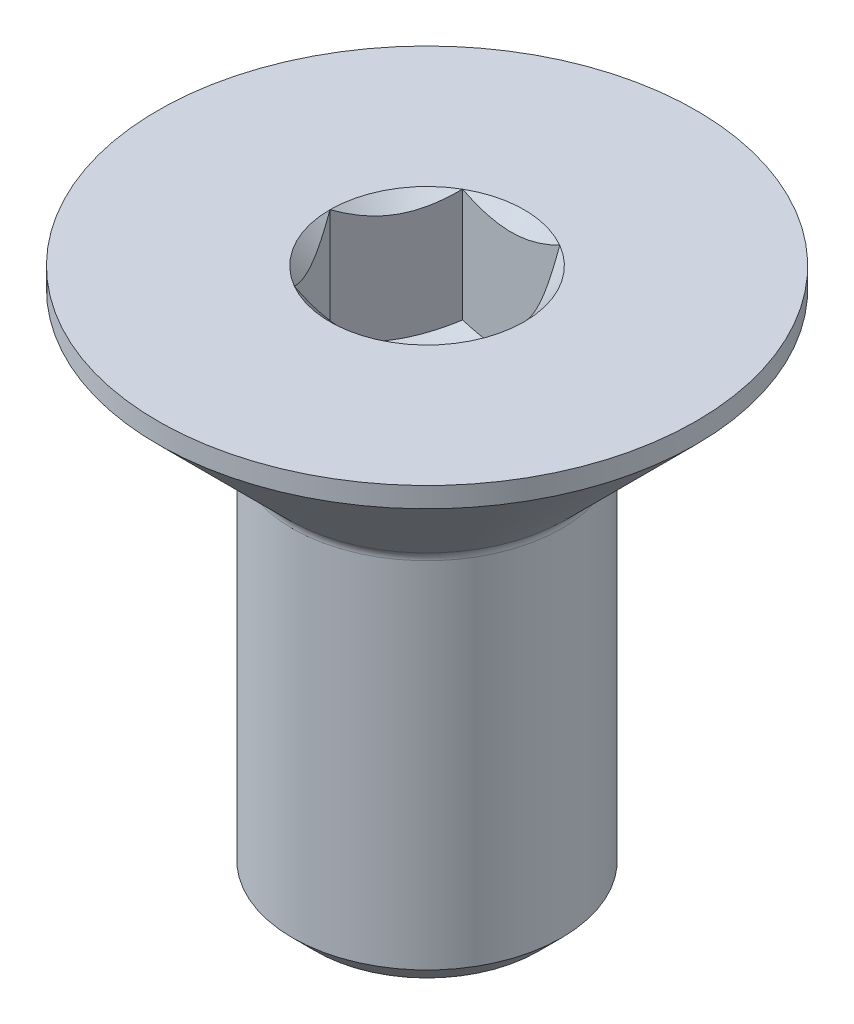
ISO-10303-21;
HEADER;
FILE_DESCRIPTION(('STEP AP214'),'2;1');
FILE_NAME('part.step','',(''),(''),'','','');
FILE_SCHEMA(('AUTOMOTIVE_DESIGN { 1 0 10303 214 1 1 1 1 }'));
ENDSEC;
DATA;
#1=APPLICATION_CONTEXT('core data for automotive mechanical design processes');
#2=APPLICATION_PROTOCOL_DEFINITION('international standard','automotive_design',2000,#1);
#3=PRODUCT_CONTEXT('',#1,'mechanical');
#4=PRODUCT('Part','Part','',(#3));
#5=PRODUCT_RELATED_PRODUCT_CATEGORY('part','',(#4));
#6=PRODUCT_DEFINITION_FORMATION('','',#4);
#7=PRODUCT_DEFINITION_CONTEXT('part definition',#1,'design');
#8=PRODUCT_DEFINITION('design','',#6,#7);
#9=PRODUCT_DEFINITION_SHAPE('','',#8);
#10=(LENGTH_UNIT() NAMED_UNIT(*) SI_UNIT(.MILLI.,.METRE.));
#11=(NAMED_UNIT(*) PLANE_ANGLE_UNIT() SI_UNIT($,.RADIAN.));
#12=(NAMED_UNIT(*) SI_UNIT($,.STERADIAN.) SOLID_ANGLE_UNIT());
#13=UNCERTAINTY_MEASURE_WITH_UNIT(LENGTH_MEASURE(1.E-05),#10,'distance_accuracy_value','');
#14=(GEOMETRIC_REPRESENTATION_CONTEXT(3) GLOBAL_UNCERTAINTY_ASSIGNED_CONTEXT((#13)) GLOBAL_UNIT_ASSIGNED_CONTEXT((#10,
#11,#12)) REPRESENTATION_CONTEXT('',''));
#15=CARTESIAN_POINT('',(0.,0.,0.));
#16=DIRECTION('',(0.,0.,1.));
#17=DIRECTION('',(1.,0.,0.));
#18=AXIS2_PLACEMENT_3D('',#15,#16,#17);
#19=CARTESIAN_POINT('',(1.65000000000349,-8.,0.));
#20=DIRECTION('',(0.,-1.,0.));
#21=DIRECTION('',(1.,0.,0.));
#22=AXIS2_PLACEMENT_3D('',#19,#20,#21);
#23=PLANE('',#22);
#24=CARTESIAN_POINT('',(0.,-8.00000000000001,0.));
#25=DIRECTION('',(0.,-1.,0.));
#26=DIRECTION('',(1.,0.,0.));
#27=AXIS2_PLACEMENT_3D('',#24,#25,#26);
#28=CIRCLE('',#27,1.65000000000346);
#29=CARTESIAN_POINT('',(1.65000000000349,-8.,0.));
#30=VERTEX_POINT('',#29);
#31=EDGE_CURVE('E45',#30,#30,#28,.T.);
#32=ORIENTED_EDGE('',*,*,#31,.T.);
#33=EDGE_LOOP('',(#32));
#34=FACE_BOUND('',#33,.T.);
#35=ADVANCED_FACE('F32',(#34),#23,.T.);
#36=CARTESIAN_POINT('',(0.,-8.00000000000001,0.));
#37=DIRECTION('',(0.,1.,0.));
#38=DIRECTION('',(-1.,0.,0.));
#39=AXIS2_PLACEMENT_3D('',#36,#37,#38);
#40=CONICAL_SURFACE('',#39,1.65000000000346,0.785398163397346);
#41=CARTESIAN_POINT('',(0.,-7.64999999999993,0.));
#42=DIRECTION('',(0.,-1.,0.));
#43=DIRECTION('',(1.,0.,0.));
#44=AXIS2_PLACEMENT_3D('',#41,#42,#43);
#45=CIRCLE('',#44,2.00000000000347);
#46=CARTESIAN_POINT('',(2.00000000000349,-7.64999999999993,0.));
#47=VERTEX_POINT('',#46);
#48=EDGE_CURVE('E235',#47,#47,#45,.T.);
#49=ORIENTED_EDGE('',*,*,#48,.T.);
#50=EDGE_LOOP('',(#49));
#51=FACE_BOUND('',#50,.T.);
#52=ORIENTED_EDGE('',*,*,#31,.F.);
#53=EDGE_LOOP('',(#52));
#54=FACE_BOUND('',#53,.T.);
#55=ADVANCED_FACE('F241',(#51,#54),#40,.T.);
#56=CARTESIAN_POINT('',(3.49148133884313E-12,-1000.,0.));
#57=DIRECTION('',(0.,-1.,0.));
#58=DIRECTION('',(1.,0.,0.));
#59=AXIS2_PLACEMENT_3D('',#56,#57,#58);
#60=CYLINDRICAL_SURFACE('',#59,2.00000000000347);
#61=CARTESIAN_POINT('',(0.,-2.3828427124748,0.));
#62=DIRECTION('',(0.,-1.,0.));
#63=DIRECTION('',(1.,0.,0.));
#64=AXIS2_PLACEMENT_3D('',#61,#62,#63);
#65=CIRCLE('',#64,2.00000000000348);
#66=CARTESIAN_POINT('',(2.00000000000349,-2.38284271247479,0.));
#67=VERTEX_POINT('',#66);
#68=EDGE_CURVE('E232',#67,#67,#65,.T.);
#69=ORIENTED_EDGE('',*,*,#68,.T.);
#70=EDGE_LOOP('',(#69));
#71=FACE_BOUND('',#70,.T.);
#72=ORIENTED_EDGE('',*,*,#48,.F.);
#73=EDGE_LOOP('',(#72));
#74=FACE_BOUND('',#73,.T.);
#75=ADVANCED_FACE('F243',(#71,#74),#60,.T.);
#76=CARTESIAN_POINT('',(0.,-2.3828427124748,0.));
#77=DIRECTION('',(0.,-1.,0.));
#78=DIRECTION('',(1.,0.,0.));
#79=AXIS2_PLACEMENT_3D('',#76,#77,#78);
#80=TOROIDAL_SURFACE('',#79,2.20000000000348,0.2);
#81=CARTESIAN_POINT('',(0.,-2.24142135623751,0.));
#82=DIRECTION('',(0.,-1.,0.));
#83=DIRECTION('',(1.,0.,0.));
#84=AXIS2_PLACEMENT_3D('',#81,#82,#83);
#85=CIRCLE('',#84,2.05857864376617);
#86=CARTESIAN_POINT('',(2.05857864376618,-2.2414213562375,0.));
#87=VERTEX_POINT('',#86);
#88=EDGE_CURVE('E229',#87,#87,#85,.T.);
#89=ORIENTED_EDGE('',*,*,#88,.T.);
#90=EDGE_LOOP('',(#89));
#91=FACE_BOUND('',#90,.T.);
#92=ORIENTED_EDGE('',*,*,#68,.F.);
#93=EDGE_LOOP('',(#92));
#94=FACE_BOUND('',#93,.T.);
#95=ADVANCED_FACE('F249',(#91,#94),#80,.F.);
#96=CARTESIAN_POINT('',(0.,-2.24142135623751,0.));
#97=DIRECTION('',(0.,1.,0.));
#98=DIRECTION('',(-1.,0.,0.));
#99=AXIS2_PLACEMENT_3D('',#96,#97,#98);
#100=CONICAL_SURFACE('',#99,2.05857864376617,0.785398163397393);
#101=CARTESIAN_POINT('',(0.,-0.299999999999967,0.));
#102=DIRECTION('',(0.,-1.,0.));
#103=DIRECTION('',(1.,0.,0.));
#104=AXIS2_PLACEMENT_3D('',#101,#102,#103);
#105=CIRCLE('',#104,4.00000000000349);
#106=CARTESIAN_POINT('',(4.00000000000349,-0.299999999999953,0.));
#107=VERTEX_POINT('',#106);
#108=EDGE_CURVE('E226',#107,#107,#105,.T.);
#109=ORIENTED_EDGE('',*,*,#108,.T.);
#110=EDGE_LOOP('',(#109));
#111=FACE_BOUND('',#110,.T.);
#112=ORIENTED_EDGE('',*,*,#88,.F.);
#113=EDGE_LOOP('',(#112));
#114=FACE_BOUND('',#113,.T.);
#115=ADVANCED_FACE('F255',(#111,#114),#100,.T.);
#116=CARTESIAN_POINT('',(3.49148133884313E-12,-1000.,0.));
#117=DIRECTION('',(0.,-1.,0.));
#118=DIRECTION('',(1.,0.,0.));
#119=AXIS2_PLACEMENT_3D('',#116,#117,#118);
#120=CYLINDRICAL_SURFACE('',#119,4.00000000000349);
#121=CARTESIAN_POINT('',(0.,0.,0.));
#122=DIRECTION('',(0.,-1.,0.));
#123=DIRECTION('',(1.,0.,0.));
#124=AXIS2_PLACEMENT_3D('',#121,#122,#123);
#125=CIRCLE('',#124,4.00000000000349);
#126=CARTESIAN_POINT('',(4.00000000000349,0.,0.));
#127=VERTEX_POINT('',#126);
#128=EDGE_CURVE('E223',#127,#127,#125,.T.);
#129=ORIENTED_EDGE('',*,*,#128,.T.);
#130=EDGE_LOOP('',(#129));
#131=FACE_BOUND('',#130,.T.);
#132=ORIENTED_EDGE('',*,*,#108,.F.);
#133=EDGE_LOOP('',(#132));
#134=FACE_BOUND('',#133,.T.);
#135=ADVANCED_FACE('F259',(#131,#134),#120,.T.);
#136=CARTESIAN_POINT('',(1.25000000000349,0.,0.));
#137=DIRECTION('',(0.,1.,0.));
#138=DIRECTION('',(-1.,0.,0.));
#139=AXIS2_PLACEMENT_3D('',#136,#137,#138);
#140=PLANE('',#139);
#141=CARTESIAN_POINT('',(0.,0.,0.));
#142=DIRECTION('',(0.,-1.,0.));
#143=DIRECTION('',(1.,0.,0.));
#144=AXIS2_PLACEMENT_3D('',#141,#142,#143);
#145=CIRCLE('',#144,1.4433756729781);
#146=CARTESIAN_POINT('',(-0.721687836489047,0.,1.25000000000349));
#147=VERTEX_POINT('',#146);
#148=CARTESIAN_POINT('',(-1.4433756729781,0.,0.));
#149=VERTEX_POINT('',#148);
#150=EDGE_CURVE('E103',#147,#149,#145,.T.);
#151=ORIENTED_EDGE('',*,*,#150,.T.);
#152=CARTESIAN_POINT('',(-0.721687836489048,0.,-1.25000000000349));
#153=VERTEX_POINT('',#152);
#154=EDGE_CURVE('E94',#149,#153,#145,.T.);
#155=ORIENTED_EDGE('',*,*,#154,.T.);
#156=CARTESIAN_POINT('',(0.721687836489048,0.,-1.25000000000349));
#157=VERTEX_POINT('',#156);
#158=EDGE_CURVE('E104',#153,#157,#145,.T.);
#159=ORIENTED_EDGE('',*,*,#158,.T.);
#160=CARTESIAN_POINT('',(1.4433756729781,0.,0.));
#161=VERTEX_POINT('',#160);
#162=EDGE_CURVE('E51',#157,#161,#145,.T.);
#163=ORIENTED_EDGE('',*,*,#162,.T.);
#164=CARTESIAN_POINT('',(0.721687836489048,0.,1.25000000000349));
#165=VERTEX_POINT('',#164);
#166=EDGE_CURVE('E58',#161,#165,#145,.T.);
#167=ORIENTED_EDGE('',*,*,#166,.T.);
#168=EDGE_CURVE('E132',#165,#147,#145,.T.);
#169=ORIENTED_EDGE('',*,*,#168,.T.);
#170=EDGE_LOOP('',(#151,#155,#159,#163,#167,#169));
#171=FACE_BOUND('',#170,.T.);
#172=ORIENTED_EDGE('',*,*,#128,.F.);
#173=EDGE_LOOP('',(#172));
#174=FACE_BOUND('',#173,.T.);
#175=ADVANCED_FACE('F130',(#171,#174),#140,.T.);
#176=CARTESIAN_POINT('',(0.,-1.44337567297459,0.));
#177=DIRECTION('',(0.,1.,0.));
#178=DIRECTION('',(-1.,0.,0.));
#179=AXIS2_PLACEMENT_3D('',#176,#177,#178);
#180=CONICAL_SURFACE('',#179,3.486441819616E-12,0.785398163397455);
#181=ORIENTED_EDGE('',*,*,#150,.F.);
#182=CARTESIAN_POINT('',(-1.44349114303193,0.000115483909129891,-0.000199999999999219));
#183=CARTESIAN_POINT('',(-1.41867941875461,-0.0246783319449714,0.0427751670717079));
#184=CARTESIAN_POINT('',(-1.39345276981132,-0.0480162655814565,0.0864690047461916));
#185=CARTESIAN_POINT('',(-1.34201263554569,-0.0907479959157224,0.175565930842435));
#186=CARTESIAN_POINT('',(-1.31579425481644,-0.110118007639899,0.220977498357684));
#187=CARTESIAN_POINT('',(-1.26292610442599,-0.143299516586928,0.312547820936136));
#188=CARTESIAN_POINT('',(-1.23628980770816,-0.157194440947788,0.358683240176892));
#189=CARTESIAN_POINT('',(-1.18243062538838,-0.178602717839864,0.45197008040886));
#190=CARTESIAN_POINT('',(-1.15520938654084,-0.186132058433737,0.499118649137779));
#191=CARTESIAN_POINT('',(-1.10829684367776,-0.192925501949839,0.580373556888879));
#192=CARTESIAN_POINT('',(-1.08866617257262,-0.193931440896195,0.614374876629663));
#193=CARTESIAN_POINT('',(-1.04943932800904,-0.19223858508922,0.68231776443439));
#194=CARTESIAN_POINT('',(-1.02984316311886,-0.189538972784993,0.716259317657666));
#195=CARTESIAN_POINT('',(-0.990839954606261,-0.180591069684128,0.783814856459697));
#196=CARTESIAN_POINT('',(-0.971433104251478,-0.174339474100782,0.817428507289067));
#197=CARTESIAN_POINT('',(-0.932943395612505,-0.158624318586539,0.884094638220292));
#198=CARTESIAN_POINT('',(-0.913860680100846,-0.149159379912958,0.917146871032868));
#199=CARTESIAN_POINT('',(-0.864986351356978,-0.121068609312751,1.00179969160307));
#200=CARTESIAN_POINT('',(-0.835502920151405,-0.10032984254808,1.05286649243259));
#201=CARTESIAN_POINT('',(-0.777690319478078,-0.0536128653286748,1.15300085411648));
#202=CARTESIAN_POINT('',(-0.749357745600508,-0.0276517040533135,1.20207431158163));
#203=CARTESIAN_POINT('',(-0.721572366435209,0.000115483909132839,1.25020000000349));
#204=B_SPLINE_CURVE_WITH_KNOTS('',3,(#182,#183,#184,#185,#186,#187,#188,#189,#190,#191,#192,
#193,#194,#195,#196,#197,#198,#199,#200,#201,#202,#203),.UNSPECIFIED.,.F.,.F.,(4,2,2,2,2,2,2,2,
2,2,4),(0.,0.16653340961877,0.334037607290696,0.498880396491094,0.663307919242131,
0.780963963461013,0.89864597015097,1.01643764861058,1.13427993171867,1.3214865203251,
1.50809158792994),.UNSPECIFIED.);
#205=EDGE_CURVE('E11',#149,#147,#204,.T.);
#206=ORIENTED_EDGE('',*,*,#205,.F.);
#207=EDGE_LOOP('',(#181,#206));
#208=FACE_BOUND('',#207,.T.);
#209=ADVANCED_FACE('F108',(#208),#180,.F.);
#210=ORIENTED_EDGE('',*,*,#168,.F.);
#211=CARTESIAN_POINT('',(-1.43934010829456,0.462982097051989,1.25000000000349));
#212=CARTESIAN_POINT('',(-1.4042931302644,0.43652492278638,1.25000000000349));
#213=CARTESIAN_POINT('',(-1.3690508715578,0.410327160501609,1.25000000000349));
#214=CARTESIAN_POINT('',(-1.29809650725286,0.358557571974628,1.25000000000349));
#215=CARTESIAN_POINT('',(-1.26238428594864,0.332985904485213,1.25000000000349));
#216=CARTESIAN_POINT('',(-1.15390111809222,0.257005993799896,1.25000000000349));
#217=CARTESIAN_POINT('',(-1.08031646741517,0.20774028628773,1.25000000000349));
#218=CARTESIAN_POINT('',(-0.926012322880137,0.111025830336069,1.25000000000349));
#219=CARTESIAN_POINT('',(-0.845125318766239,0.0638412990018703,1.25000000000349));
#220=CARTESIAN_POINT('',(-0.679311174155533,-0.022469265573359,1.25000000000349));
#221=CARTESIAN_POINT('',(-0.594398891089416,-0.0616224653478704,1.25000000000349));
#222=CARTESIAN_POINT('',(-0.46694481251109,-0.109522776294703,1.25000000000349));
#223=CARTESIAN_POINT('',(-0.426289985868076,-0.123270510196388,1.25000000000349));
#224=CARTESIAN_POINT('',(-0.343998850156493,-0.147502072532647,1.25000000000349));
#225=CARTESIAN_POINT('',(-0.302362473685254,-0.157985676114154,1.25000000000349));
#226=CARTESIAN_POINT('',(-0.219052696365918,-0.174969838238265,1.25000000000349));
#227=CARTESIAN_POINT('',(-0.177393428559645,-0.181538639517064,1.25000000000349));
#228=CARTESIAN_POINT('',(-0.0936293694349521,-0.190564946535536,1.25000000000349));
#229=CARTESIAN_POINT('',(-0.0515246559538788,-0.193023158999019,1.25000000000349));
#230=CARTESIAN_POINT('',(0.0311890575224513,-0.193645937989816,1.25000000000349));
#231=CARTESIAN_POINT('',(0.0717969624377628,-0.191962883160621,1.25000000000349));
#232=CARTESIAN_POINT('',(0.152668636765459,-0.184731729417062,1.25000000000349));
#233=CARTESIAN_POINT('',(0.192932338712038,-0.17918288960621,1.25000000000349));
#234=CARTESIAN_POINT('',(0.273499879034908,-0.164428963563456,1.25000000000349));
#235=CARTESIAN_POINT('',(0.313792180484651,-0.155161824069079,1.25000000000349));
#236=CARTESIAN_POINT('',(0.393496413770995,-0.133463821585486,1.25000000000349));
#237=CARTESIAN_POINT('',(0.432908418971468,-0.121033223317061,1.25000000000349));
#238=CARTESIAN_POINT('',(0.55699273568753,-0.0772206471392824,1.25000000000349));
#239=CARTESIAN_POINT('',(0.639898924464845,-0.0408489272159497,1.25000000000349));
#240=CARTESIAN_POINT('',(0.801816555247556,0.0400191620417341,1.25000000000349));
#241=CARTESIAN_POINT('',(0.880812666048479,0.0845447207518592,1.25000000000349));
#242=CARTESIAN_POINT('',(1.03178561247705,0.176404876461487,1.25000000000349));
#243=CARTESIAN_POINT('',(1.10391618451079,0.223489933689833,1.25000000000349));
#244=CARTESIAN_POINT('',(1.21018606006404,0.296278561340321,1.25000000000349));
#245=CARTESIAN_POINT('',(1.24515069931519,0.320798085124626,1.25000000000349));
#246=CARTESIAN_POINT('',(1.31460220812977,0.370485636475934,1.25000000000349));
#247=CARTESIAN_POINT('',(1.34908920555911,0.395653485115273,1.25000000000349));
#248=CARTESIAN_POINT('',(1.3833773164126,0.42109014853048,1.25000000000349));
#249=B_SPLINE_CURVE_WITH_KNOTS('',3,(#211,#212,#213,#214,#215,#216,#217,#218,#219,#220,#221,
#222,#223,#224,#225,#226,#227,#228,#229,#230,#231,#232,#233,#234,#235,#236,#237,#238,#239,#240,
#241,#242,#243,#244,#245,#246,#247,#248),.UNSPECIFIED.,.F.,.F.,(4,2,2,2,2,2,2,2,2,2,2,2,2,2,2,2,
2,2,4),(0.,0.131732960406922,0.263498984212599,0.529042014558685,0.809741926295641,
1.08947609739089,1.21811634293026,1.34676544802937,1.47310084535527,1.59941451990114,
1.72115042182942,1.84290966145587,1.96679153917858,2.09066305377221,2.36146692897408,
2.63325989190042,2.89154668195411,3.01965734486693,3.14773302220456),.UNSPECIFIED.);
#250=EDGE_CURVE('E134',#147,#165,#249,.T.);
#251=ORIENTED_EDGE('',*,*,#250,.F.);
#252=EDGE_LOOP('',(#210,#251));
#253=FACE_BOUND('',#252,.T.);
#254=ADVANCED_FACE('F267',(#253),#180,.F.);
#255=ORIENTED_EDGE('',*,*,#166,.F.);
#256=CARTESIAN_POINT('',(0.721572366435211,0.00011548390913795,1.25020000000349));
#257=CARTESIAN_POINT('',(0.74638409071253,-0.0246783319449632,1.20722483293178));
#258=CARTESIAN_POINT('',(0.771610739655821,-0.0480162655814483,1.1635309952573));
#259=CARTESIAN_POINT('',(0.823050873921455,-0.090747995915714,1.07443406916106));
#260=CARTESIAN_POINT('',(0.849269254650707,-0.110118007639891,1.02902250164581));
#261=CARTESIAN_POINT('',(0.902137405041158,-0.14329951658692,0.937452179067356));
#262=CARTESIAN_POINT('',(0.928773701758984,-0.15719444094778,0.891316759826601));
#263=CARTESIAN_POINT('',(0.98263288407876,-0.178602717839856,0.798029919594633));
#264=CARTESIAN_POINT('',(1.00985412292631,-0.186132058433728,0.750881350865714));
#265=CARTESIAN_POINT('',(1.05676666578938,-0.192925501949831,0.669626443114614));
#266=CARTESIAN_POINT('',(1.07639733689453,-0.193931440896187,0.635625123373829));
#267=CARTESIAN_POINT('',(1.11562418145811,-0.192238585089212,0.567682235569102));
#268=CARTESIAN_POINT('',(1.13522034634828,-0.189538972784985,0.533740682345827));
#269=CARTESIAN_POINT('',(1.17422355486088,-0.18059106968412,0.466185143543795));
#270=CARTESIAN_POINT('',(1.19363040521567,-0.174339474100774,0.432571492714426));
#271=CARTESIAN_POINT('',(1.23212011385464,-0.158624318586531,0.3659053617832));
#272=CARTESIAN_POINT('',(1.2512028293663,-0.14915937991295,0.332853128970625));
#273=CARTESIAN_POINT('',(1.30007715811017,-0.121068609312744,0.248200308400421));
#274=CARTESIAN_POINT('',(1.32956058931574,-0.100329842548072,0.197133507570906));
#275=CARTESIAN_POINT('',(1.38737318998907,-0.0536128653286669,0.0969991458870134));
#276=CARTESIAN_POINT('',(1.41570576386664,-0.0276517040533056,0.0479256884218633));
#277=CARTESIAN_POINT('',(1.44349114303193,0.000115483909140393,-0.000200000000000403));
#278=B_SPLINE_CURVE_WITH_KNOTS('',3,(#256,#257,#258,#259,#260,#261,#262,#263,#264,#265,#266,
#267,#268,#269,#270,#271,#272,#273,#274,#275,#276,#277),.UNSPECIFIED.,.F.,.F.,(4,2,2,2,2,2,2,2,
2,2,4),(0.,0.166533409618769,0.334037607290696,0.498880396491094,0.663307919242131,
0.780963963461013,0.89864597015097,1.01643764861058,1.13427993171867,1.3214865203251,
1.50809158792994),.UNSPECIFIED.);
#279=EDGE_CURVE('E142',#165,#161,#278,.T.);
#280=ORIENTED_EDGE('',*,*,#279,.F.);
#281=EDGE_LOOP('',(#255,#280));
#282=FACE_BOUND('',#281,.T.);
#283=ADVANCED_FACE('F271',(#282),#180,.F.);
#284=ORIENTED_EDGE('',*,*,#162,.F.);
#285=CARTESIAN_POINT('',(1.44349114303193,0.000115483909140748,0.000199999999999486));
#286=CARTESIAN_POINT('',(1.41867941875462,-0.0246783319449607,-0.0427751670717077));
#287=CARTESIAN_POINT('',(1.39345276981132,-0.048016265581446,-0.0864690047461914));
#288=CARTESIAN_POINT('',(1.34201263554569,-0.0907479959157123,-0.175565930842435));
#289=CARTESIAN_POINT('',(1.31579425481644,-0.110118007639889,-0.220977498357684));
#290=CARTESIAN_POINT('',(1.26292610442599,-0.143299516586919,-0.312547820936137));
#291=CARTESIAN_POINT('',(1.23628980770816,-0.157194440947779,-0.358683240176892));
#292=CARTESIAN_POINT('',(1.18243062538839,-0.178602717839855,-0.45197008040886));
#293=CARTESIAN_POINT('',(1.15520938654084,-0.186132058433728,-0.499118649137779));
#294=CARTESIAN_POINT('',(1.10829684367776,-0.192925501949831,-0.580373556888879));
#295=CARTESIAN_POINT('',(1.08866617257262,-0.193931440896187,-0.614374876629663));
#296=CARTESIAN_POINT('',(1.04943932800904,-0.192238585089213,-0.68231776443439));
#297=CARTESIAN_POINT('',(1.02984316311887,-0.189538972784986,-0.716259317657666));
#298=CARTESIAN_POINT('',(0.990839954606263,-0.180591069684121,-0.783814856459697));
#299=CARTESIAN_POINT('',(0.97143310425148,-0.174339474100775,-0.817428507289067));
#300=CARTESIAN_POINT('',(0.932943395612506,-0.158624318586532,-0.884094638220292));
#301=CARTESIAN_POINT('',(0.913860680100848,-0.149159379912951,-0.917146871032868));
#302=CARTESIAN_POINT('',(0.864986351356979,-0.121068609312745,-1.00179969160307));
#303=CARTESIAN_POINT('',(0.835502920151406,-0.100329842548073,-1.05286649243259));
#304=CARTESIAN_POINT('',(0.777690319478079,-0.0536128653286691,-1.15300085411648));
#305=CARTESIAN_POINT('',(0.749357745600509,-0.0276517040533081,-1.20207431158163));
#306=CARTESIAN_POINT('',(0.72157236643521,0.00011548390913791,-1.25020000000349));
#307=B_SPLINE_CURVE_WITH_KNOTS('',3,(#285,#286,#287,#288,#289,#290,#291,#292,#293,#294,#295,
#296,#297,#298,#299,#300,#301,#302,#303,#304,#305,#306),.UNSPECIFIED.,.F.,.F.,(4,2,2,2,2,2,2,2,
2,2,4),(0.,0.16653340961877,0.334037607290697,0.498880396491095,0.663307919242131,
0.780963963461014,0.89864597015097,1.01643764861058,1.13427993171867,1.3214865203251,
1.50809158792994),.UNSPECIFIED.);
#308=EDGE_CURVE('E164',#161,#157,#307,.T.);
#309=ORIENTED_EDGE('',*,*,#308,.F.);
#310=EDGE_LOOP('',(#284,#309));
#311=FACE_BOUND('',#310,.T.);
#312=ADVANCED_FACE('F276',(#311),#180,.F.);
#313=ORIENTED_EDGE('',*,*,#158,.F.);
#314=CARTESIAN_POINT('',(-1.43934010808536,0.46298209689404,-1.25000000000349));
#315=CARTESIAN_POINT('',(-1.40429313006107,0.436524922634515,-1.25000000000349));
#316=CARTESIAN_POINT('',(-1.36905087136036,0.41032716035582,-1.25000000000349));
#317=CARTESIAN_POINT('',(-1.29809650706726,0.358557571840954,-1.25000000000349));
#318=CARTESIAN_POINT('',(-1.26238428576899,0.332985904357579,-1.25000000000349));
#319=CARTESIAN_POINT('',(-1.15390111793078,0.257005993690498,-1.25000000000349));
#320=CARTESIAN_POINT('',(-1.08031646726612,0.207740286190437,-1.25000000000349));
#321=CARTESIAN_POINT('',(-0.926012322758085,0.111025830263676,-1.25000000000349));
#322=CARTESIAN_POINT('',(-0.84512531865888,0.0638412989421791,-1.25000000000349));
#323=CARTESIAN_POINT('',(-0.679311174078812,-0.0224692656095032,-1.25000000000349));
#324=CARTESIAN_POINT('',(-0.594398891028629,-0.061622465373154,-1.25000000000349));
#325=CARTESIAN_POINT('',(-0.466944812462283,-0.109522776311931,-1.25000000000349));
#326=CARTESIAN_POINT('',(-0.426289985814242,-0.123270510213935,-1.25000000000349));
#327=CARTESIAN_POINT('',(-0.34399885009244,-0.147502072549813,-1.25000000000349));
#328=CARTESIAN_POINT('',(-0.302362473616009,-0.157985676130621,-1.25000000000349));
#329=CARTESIAN_POINT('',(-0.21905269628646,-0.174969838252159,-1.25000000000349));
#330=CARTESIAN_POINT('',(-0.177393428475169,-0.181538639529113,-1.25000000000349));
#331=CARTESIAN_POINT('',(-0.0936293693406071,-0.190564946542761,-1.25000000000349));
#332=CARTESIAN_POINT('',(-0.0515246558546831,-0.193023159003264,-1.25000000000349));
#333=CARTESIAN_POINT('',(0.0311890576305937,-0.193645937987258,-1.25000000000349));
#334=CARTESIAN_POINT('',(0.0717969625500137,-0.191962883154295,-1.25000000000349));
#335=CARTESIAN_POINT('',(0.152668636885522,-0.184731729402613,-1.25000000000349));
#336=CARTESIAN_POINT('',(0.192932338835803,-0.179182889587405,-1.25000000000349));
#337=CARTESIAN_POINT('',(0.273499879165982,-0.164428963535521,-1.25000000000349));
#338=CARTESIAN_POINT('',(0.313792180619318,-0.155161824036343,-1.25000000000349));
#339=CARTESIAN_POINT('',(0.393496413912503,-0.13346382154304,-1.25000000000349));
#340=CARTESIAN_POINT('',(0.432908419116223,-0.121033223269706,-1.25000000000349));
#341=CARTESIAN_POINT('',(0.55699273586381,-0.0772206470687936,-1.25000000000349));
#342=CARTESIAN_POINT('',(0.639898924667823,-0.0408489271241785,-1.25000000000349));
#343=CARTESIAN_POINT('',(0.801816555501879,0.0400191621784154,-1.25000000000349));
#344=CARTESIAN_POINT('',(0.880812666327437,0.084544720912185,-1.25000000000349));
#345=CARTESIAN_POINT('',(1.0317856128003,0.176404876667069,-1.25000000000349));
#346=CARTESIAN_POINT('',(1.10391618485386,0.22348993391682,-1.25000000000349));
#347=CARTESIAN_POINT('',(1.2101860604364,0.296278561599304,-1.25000000000349));
#348=CARTESIAN_POINT('',(1.24515069969718,0.32079808539419,-1.25000000000349));
#349=CARTESIAN_POINT('',(1.31460220853094,0.370485636766646,-1.25000000000349));
#350=CARTESIAN_POINT('',(1.34908920596985,0.395653485416553,-1.25000000000349));
#351=CARTESIAN_POINT('',(1.38337731683288,0.421090148842315,-1.25000000000349));
#352=B_SPLINE_CURVE_WITH_KNOTS('',3,(#314,#315,#316,#317,#318,#319,#320,#321,#322,#323,#324,
#325,#326,#327,#328,#329,#330,#331,#332,#333,#334,#335,#336,#337,#338,#339,#340,#341,#342,#343,
#344,#345,#346,#347,#348,#349,#350,#351),.UNSPECIFIED.,.F.,.F.,(4,2,2,2,2,2,2,2,2,2,2,2,2,2,2,2,
2,2,4),(0.,0.131732960381867,0.263498984162482,0.529042014457507,0.809741926137206,
1.08947609717574,1.21811634272965,1.34676544784328,1.4731008451831,1.59941451974289,
1.7211504216839,1.84290966132312,1.96679153905956,2.0906630536669,2.36146692896733,
2.63325989199289,2.89154668213147,3.01965734508616,3.14773302246566),.UNSPECIFIED.);
#353=EDGE_CURVE('E121',#157,#153,#352,.F.);
#354=ORIENTED_EDGE('',*,*,#353,.F.);
#355=EDGE_LOOP('',(#313,#354));
#356=FACE_BOUND('',#355,.T.);
#357=ADVANCED_FACE('F155',(#356),#180,.F.);
#358=ORIENTED_EDGE('',*,*,#154,.F.);
#359=CARTESIAN_POINT('',(-0.72157236643521,0.000115483909132866,-1.25020000000349));
#360=CARTESIAN_POINT('',(-0.746384090712529,-0.0246783319449688,-1.20722483293178));
#361=CARTESIAN_POINT('',(-0.77161073965582,-0.0480162655814541,-1.1635309952573));
#362=CARTESIAN_POINT('',(-0.823050873921454,-0.0907479959157204,-1.07443406916106));
#363=CARTESIAN_POINT('',(-0.849269254650706,-0.110118007639897,-1.02902250164581));
#364=CARTESIAN_POINT('',(-0.902137405041157,-0.143299516586927,-0.937452179067356));
#365=CARTESIAN_POINT('',(-0.928773701758983,-0.157194440947786,-0.891316759826601));
#366=CARTESIAN_POINT('',(-0.982632884078759,-0.178602717839863,-0.798029919594632));
#367=CARTESIAN_POINT('',(-1.00985412292631,-0.186132058433736,-0.750881350865713));
#368=CARTESIAN_POINT('',(-1.05676666578938,-0.192925501949839,-0.669626443114613));
#369=CARTESIAN_POINT('',(-1.07639733689453,-0.193931440896195,-0.635625123373828));
#370=CARTESIAN_POINT('',(-1.11562418145811,-0.192238585089221,-0.567682235569101));
#371=CARTESIAN_POINT('',(-1.13522034634828,-0.189538972784994,-0.533740682345826));
#372=CARTESIAN_POINT('',(-1.17422355486088,-0.180591069684129,-0.466185143543794));
#373=CARTESIAN_POINT('',(-1.19363040521566,-0.174339474100783,-0.432571492714424));
#374=CARTESIAN_POINT('',(-1.23212011385464,-0.15862431858654,-0.365905361783199));
#375=CARTESIAN_POINT('',(-1.2512028293663,-0.149159379912959,-0.332853128970624));
#376=CARTESIAN_POINT('',(-1.30007715811016,-0.121068609312753,-0.24820030840042));
#377=CARTESIAN_POINT('',(-1.32956058931574,-0.100329842548082,-0.197133507570906));
#378=CARTESIAN_POINT('',(-1.38737318998906,-0.0536128653286775,-0.0969991458870126));
#379=CARTESIAN_POINT('',(-1.41570576386663,-0.0276517040533165,-0.0479256884218625));
#380=CARTESIAN_POINT('',(-1.44349114303193,0.00011548390913005,0.000200000000000735));
#381=B_SPLINE_CURVE_WITH_KNOTS('',3,(#359,#360,#361,#362,#363,#364,#365,#366,#367,#368,#369,
#370,#371,#372,#373,#374,#375,#376,#377,#378,#379,#380),.UNSPECIFIED.,.F.,.F.,(4,2,2,2,2,2,2,2,
2,2,4),(0.,0.16653340961877,0.334037607290697,0.498880396491095,0.663307919242132,
0.780963963461014,0.898645970150971,1.01643764861058,1.13427993171867,1.3214865203251,
1.50809158792995),.UNSPECIFIED.);
#382=EDGE_CURVE('E98',#153,#149,#381,.T.);
#383=ORIENTED_EDGE('',*,*,#382,.F.);
#384=EDGE_LOOP('',(#358,#383));
#385=FACE_BOUND('',#384,.T.);
#386=ADVANCED_FACE('F96',(#385),#180,.F.);
#387=CARTESIAN_POINT('',(0.,-1.80000000000002,0.));
#388=DIRECTION('',(0.,1.,0.));
#389=DIRECTION('',(-1.,0.,0.));
#390=AXIS2_PLACEMENT_3D('',#387,#388,#389);
#391=CONICAL_SURFACE('',#390,1.25000000000349,1.02974425867668);
#392=CARTESIAN_POINT('',(3.49148133884313E-12,-2.55107577378444,0.));
#393=VERTEX_POINT('',#392);
#394=VERTEX_LOOP('',#393);
#395=FACE_BOUND('',#394,.T.);
#396=CARTESIAN_POINT('',(-1.44349114303193,-1.68373878369851,0.000200000000000758));
#397=CARTESIAN_POINT('',(-1.41166056552225,-1.70287413373893,-0.0549321774810273));
#398=CARTESIAN_POINT('',(-1.37953238678244,-1.72028548653005,-0.110579815413018));
#399=CARTESIAN_POINT('',(-1.31467131835564,-1.75066975163604,-0.22292248136144));
#400=CARTESIAN_POINT('',(-1.28193705101929,-1.76363077161949,-0.279619895536542));
#401=CARTESIAN_POINT('',(-1.21690829049723,-1.78373800140125,-0.39225301271398));
#402=CARTESIAN_POINT('',(-1.18462556763811,-1.79103091489728,-0.448168328912636));
#403=CARTESIAN_POINT('',(-1.11989904931318,-1.79964889962364,-0.560277947248452));
#404=CARTESIAN_POINT('',(-1.08745553287882,-1.80098207990487,-0.616471766088976));
#405=CARTESIAN_POINT('',(-1.02711351628176,-1.79780199201309,-0.720987204666242));
#406=CARTESIAN_POINT('',(-0.999203806863338,-1.79406783704458,-0.76932823940343));
#407=CARTESIAN_POINT('',(-0.943582164544166,-1.78236747410617,-0.86566774990066));
#408=CARTESIAN_POINT('',(-0.915870460137415,-1.77439699110082,-0.913665829897483));
#409=CARTESIAN_POINT('',(-0.860127887355341,-1.75452233622549,-1.01021479810064));
#410=CARTESIAN_POINT('',(-0.832105201282622,-1.74252876876397,-1.05875151414314));
#411=CARTESIAN_POINT('',(-0.776509232231198,-1.71535561485019,-1.15504655723624));
#412=CARTESIAN_POINT('',(-0.748935115106377,-1.70018290883616,-1.20280632907028));
#413=CARTESIAN_POINT('',(-0.721572366435204,-1.68373878369851,-1.25020000000349));
#414=B_SPLINE_CURVE_WITH_KNOTS('',3,(#396,#397,#398,#399,#400,#401,#402,#403,#404,#405,#406,
#407,#408,#409,#410,#411,#412,#413),.UNSPECIFIED.,.F.,.F.,(4,2,2,2,2,2,2,2,4),(0.,
0.199512657915263,0.399554385152232,0.594228120804869,0.788636894821076,0.956299136616362,
1.12413089472599,1.29597067854706,1.46744233074892),.UNSPECIFIED.);
#415=CARTESIAN_POINT('',(-1.44337567297809,-1.68380817343164,0.));
#416=VERTEX_POINT('',#415);
#417=CARTESIAN_POINT('',(-0.72168783648918,-1.68380817343172,-1.25000000000349));
#418=VERTEX_POINT('',#417);
#419=EDGE_CURVE('E194',#416,#418,#414,.T.);
#420=ORIENTED_EDGE('',*,*,#419,.F.);
#421=CARTESIAN_POINT('',(-0.721572366435204,-1.68373878369851,1.25020000000349));
#422=CARTESIAN_POINT('',(-0.753402943944885,-1.70287413373893,1.19506782252246));
#423=CARTESIAN_POINT('',(-0.785531122684687,-1.72028548653004,1.13942018459047));
#424=CARTESIAN_POINT('',(-0.850392191111488,-1.75066975163604,1.02707751864205));
#425=CARTESIAN_POINT('',(-0.883126458447839,-1.76363077161949,0.970380104466949));
#426=CARTESIAN_POINT('',(-0.9481552189699,-1.78373800140125,0.857746987289511));
#427=CARTESIAN_POINT('',(-0.980437941829017,-1.79103091489727,0.801831671090855));
#428=CARTESIAN_POINT('',(-1.04516446015395,-1.79964889962364,0.689722052755039));
#429=CARTESIAN_POINT('',(-1.07760797658832,-1.80098207990487,0.633528233914515));
#430=CARTESIAN_POINT('',(-1.13794999318537,-1.79780199201309,0.52901279533725));
#431=CARTESIAN_POINT('',(-1.16585970260379,-1.79406783704458,0.480671760600061));
#432=CARTESIAN_POINT('',(-1.22148134492297,-1.78236747410617,0.384332250102832));
#433=CARTESIAN_POINT('',(-1.24919304932972,-1.77439699110082,0.336334170106008));
#434=CARTESIAN_POINT('',(-1.30493562211179,-1.75452233622549,0.239785201902849));
#435=CARTESIAN_POINT('',(-1.33295830818451,-1.74252876876397,0.191248485860349));
#436=CARTESIAN_POINT('',(-1.38855427723593,-1.71535561485019,0.0949534427672542));
#437=CARTESIAN_POINT('',(-1.41612839436076,-1.70018290883616,0.0471936709332087));
#438=CARTESIAN_POINT('',(-1.44349114303193,-1.68373878369851,-0.000199999999999307));
#439=B_SPLINE_CURVE_WITH_KNOTS('',3,(#421,#422,#423,#424,#425,#426,#427,#428,#429,#430,#431,
#432,#433,#434,#435,#436,#437,#438),.UNSPECIFIED.,.F.,.F.,(4,2,2,2,2,2,2,2,4),(0.,
0.199512657915263,0.399554385152233,0.594228120804869,0.788636894821076,0.956299136616363,
1.12413089472599,1.29597067854706,1.46744233074892),.UNSPECIFIED.);
#440=CARTESIAN_POINT('',(-0.721687836489041,-1.68380817343164,1.25000000000349));
#441=VERTEX_POINT('',#440);
#442=EDGE_CURVE('E125',#441,#416,#439,.T.);
#443=ORIENTED_EDGE('',*,*,#442,.F.);
#444=CARTESIAN_POINT('',(-1.95633569807406,-1.15612775041407,1.25000000000349));
#445=CARTESIAN_POINT('',(-1.90177877375264,-1.18374457873998,1.25000000000349));
#446=CARTESIAN_POINT('',(-1.84709077689568,-1.21110630849023,1.25000000000349));
#447=CARTESIAN_POINT('',(-1.73738286153345,-1.26517768956599,1.25000000000349));
#448=CARTESIAN_POINT('',(-1.68236289142449,-1.29188723607654,1.25000000000349));
#449=CARTESIAN_POINT('',(-1.57162683174927,-1.34465202901765,1.25000000000349));
#450=CARTESIAN_POINT('',(-1.51590856567755,-1.3707027285118,1.25000000000349));
#451=CARTESIAN_POINT('',(-1.40400572343869,-1.42177471825108,1.25000000000349));
#452=CARTESIAN_POINT('',(-1.34782117036307,-1.44679605911099,1.25000000000349));
#453=CARTESIAN_POINT('',(-1.17446186721262,-1.52166033554973,1.25000000000349));
#454=CARTESIAN_POINT('',(-1.05636778161659,-1.5694084237938,1.25000000000349));
#455=CARTESIAN_POINT('',(-0.816974893596707,-1.65565102430568,1.25000000000349));
#456=CARTESIAN_POINT('',(-0.695684569467109,-1.69416772529239,1.25000000000349));
#457=CARTESIAN_POINT('',(-0.511148008895669,-1.74031555097362,1.25000000000349));
#458=CARTESIAN_POINT('',(-0.449371057059273,-1.75373975965416,1.25000000000349));
#459=CARTESIAN_POINT('',(-0.324962773893435,-1.77585578640222,1.25000000000349));
#460=CARTESIAN_POINT('',(-0.262331574813842,-1.78454832866416,1.25000000000349));
#461=CARTESIAN_POINT('',(-0.137441721157349,-1.79636727757044,1.25000000000349));
#462=CARTESIAN_POINT('',(-0.0751906951126029,-1.79957205624218,1.25000000000349));
#463=CARTESIAN_POINT('',(0.0493491467112988,-1.80034769675674,1.25000000000349));
#464=CARTESIAN_POINT('',(0.111637964769692,-1.79791817598097,1.25000000000349));
#465=CARTESIAN_POINT('',(0.255543057352278,-1.78601127768817,1.25000000000349));
#466=CARTESIAN_POINT('',(0.336993495807891,-1.77453482690731,1.25000000000349));
#467=CARTESIAN_POINT('',(0.498435890885964,-1.74381125147862,1.25000000000349));
#468=CARTESIAN_POINT('',(0.578426259365225,-1.72455613761234,1.25000000000349));
#469=CARTESIAN_POINT('',(0.698169385498114,-1.6910569972249,1.25000000000349));
#470=CARTESIAN_POINT('',(0.73854181240987,-1.6789410423808,1.25000000000349));
#471=CARTESIAN_POINT('',(0.818854827558602,-1.65342511824778,1.25000000000349));
#472=CARTESIAN_POINT('',(0.858795649648098,-1.64002588754758,1.25000000000349));
#473=CARTESIAN_POINT('',(0.938293938986001,-1.61214509388012,1.25000000000349));
#474=CARTESIAN_POINT('',(0.977851414711371,-1.59766355490798,1.25000000000349));
#475=CARTESIAN_POINT('',(1.05662445455263,-1.5677871645207,1.25000000000349));
#476=CARTESIAN_POINT('',(1.09583997386484,-1.55239219542898,1.25000000000349));
#477=CARTESIAN_POINT('',(1.22650655936877,-1.49962207655801,1.25000000000349));
#478=CARTESIAN_POINT('',(1.31726645357689,-1.4605357037122,1.25000000000349));
#479=CARTESIAN_POINT('',(1.49752737704775,-1.3795480328937,1.25000000000349));
#480=CARTESIAN_POINT('',(1.58702809597521,-1.33764605519403,1.25000000000349));
#481=CARTESIAN_POINT('',(1.7651378170072,-1.25185780243867,1.25000000000349));
#482=CARTESIAN_POINT('',(1.85374623413003,-1.20797031763384,1.25000000000349));
#483=CARTESIAN_POINT('',(2.03025323651514,-1.11878711062617,1.25000000000349));
#484=CARTESIAN_POINT('',(2.11815178773777,-1.0734913213912,1.25000000000349));
#485=CARTESIAN_POINT('',(2.38149812693641,-0.935839596546094,1.25000000000349));
#486=CARTESIAN_POINT('',(2.55613976999247,-0.841944703208107,1.25000000000349));
#487=CARTESIAN_POINT('',(2.90406210123374,-0.651849748686266,1.25000000000349));
#488=CARTESIAN_POINT('',(3.0773433036529,-0.555650620295803,1.25000000000349));
#489=CARTESIAN_POINT('',(3.39747003309832,-0.37611619023932,1.25000000000349));
#490=CARTESIAN_POINT('',(3.5444304344659,-0.292985478002713,1.25000000000349));
#491=CARTESIAN_POINT('',(3.83793250552714,-0.12594868092238,1.25000000000349));
#492=CARTESIAN_POINT('',(3.98447412301873,-0.042042504500565,1.25000000000349));
#493=CARTESIAN_POINT('',(4.27653638003864,0.125923608427483,1.25000000000349));
#494=CARTESIAN_POINT('',(4.42205854939612,0.209980887303377,1.25000000000349));
#495=CARTESIAN_POINT('',(4.71283839965286,0.37850750295288,1.25000000000349));
#496=CARTESIAN_POINT('',(4.85809611306376,0.462976783611267,1.25000000000349));
#497=CARTESIAN_POINT('',(5.00326731961475,0.54759359828492,1.25000000000349));
#498=B_SPLINE_CURVE_WITH_KNOTS('',3,(#444,#445,#446,#447,#448,#449,#450,#451,#452,#453,#454,
#455,#456,#457,#458,#459,#460,#461,#462,#463,#464,#465,#466,#467,#468,#469,#470,#471,#472,#473,
#474,#475,#476,#477,#478,#479,#480,#481,#482,#483,#484,#485,#486,#487,#488,#489,#490,#491,#492,
#493,#494,#495,#496,#497),.UNSPECIFIED.,.F.,.F.,(4,2,2,2,2,2,2,2,2,2,2,2,2,2,2,2,2,2,2,2,2,2,2,
2,2,2,4),(0.,0.183447507155844,0.366924305382324,0.551437268785759,0.735941148596514,
1.11790926533022,1.49894985677451,1.68845864669467,1.87793842361723,2.06468890185729,
2.25145206247193,2.49772601247179,2.74425354833707,2.87069069682574,2.99705550686921,
3.12341751619405,3.24979584014555,3.546167550345,3.84261106773788,4.13923770389022,
4.43587848048568,5.03068780904991,5.62526028771965,6.1317869300701,6.63837417489109,
7.14253700072634,7.64663297644396),.UNSPECIFIED.);
#499=CARTESIAN_POINT('',(0.721687836489054,-1.68380817343163,1.25000000000349));
#500=VERTEX_POINT('',#499);
#501=EDGE_CURVE('E180',#500,#441,#498,.F.);
#502=ORIENTED_EDGE('',*,*,#501,.F.);
#503=CARTESIAN_POINT('',(1.44349114303194,-1.6837387836985,-0.000200000000000519));
#504=CARTESIAN_POINT('',(1.41166056552226,-1.70287413373892,0.0549321774810276));
#505=CARTESIAN_POINT('',(1.37953238678246,-1.72028548653004,0.110579815413018));
#506=CARTESIAN_POINT('',(1.31467131835566,-1.75066975163603,0.22292248136144));
#507=CARTESIAN_POINT('',(1.2819370510193,-1.76363077161948,0.279619895536542));
#508=CARTESIAN_POINT('',(1.21690829049724,-1.78373800140124,0.392253012713981));
#509=CARTESIAN_POINT('',(1.18462556763813,-1.79103091489727,0.448168328912636));
#510=CARTESIAN_POINT('',(1.1198990493132,-1.79964889962363,0.560277947248453));
#511=CARTESIAN_POINT('',(1.08745553287883,-1.80098207990486,0.616471766088977));
#512=CARTESIAN_POINT('',(1.02711351628177,-1.79780199201308,0.720987204666242));
#513=CARTESIAN_POINT('',(0.999203806863351,-1.79406783704457,0.769328239403431));
#514=CARTESIAN_POINT('',(0.943582164544179,-1.78236747410616,0.865667749900661));
#515=CARTESIAN_POINT('',(0.915870460137427,-1.77439699110081,0.913665829897484));
#516=CARTESIAN_POINT('',(0.860127887355353,-1.75452233622549,1.01021479810064));
#517=CARTESIAN_POINT('',(0.832105201282635,-1.74252876876396,1.05875151414314));
#518=CARTESIAN_POINT('',(0.77650923223121,-1.71535561485018,1.15504655723624));
#519=CARTESIAN_POINT('',(0.748935115106389,-1.70018290883616,1.20280632907028));
#520=CARTESIAN_POINT('',(0.721572366435216,-1.6837387836985,1.25020000000349));
#521=B_SPLINE_CURVE_WITH_KNOTS('',3,(#503,#504,#505,#506,#507,#508,#509,#510,#511,#512,#513,
#514,#515,#516,#517,#518,#519,#520),.UNSPECIFIED.,.F.,.F.,(4,2,2,2,2,2,2,2,4),(0.,
0.199512657915263,0.399554385152233,0.594228120804869,0.788636894821077,0.956299136616363,
1.12413089472599,1.29597067854706,1.46744233074892),.UNSPECIFIED.);
#522=CARTESIAN_POINT('',(1.4433756729781,-1.68380817343163,0.));
#523=VERTEX_POINT('',#522);
#524=EDGE_CURVE('E284',#523,#500,#521,.T.);
#525=ORIENTED_EDGE('',*,*,#524,.F.);
#526=CARTESIAN_POINT('',(0.721572366435216,-1.6837387836985,-1.25020000000349));
#527=CARTESIAN_POINT('',(0.753402943944898,-1.70287413373892,-1.19506782252246));
#528=CARTESIAN_POINT('',(0.7855311226847,-1.72028548653004,-1.13942018459047));
#529=CARTESIAN_POINT('',(0.850392191111501,-1.75066975163604,-1.02707751864205));
#530=CARTESIAN_POINT('',(0.883126458447852,-1.76363077161948,-0.970380104466949));
#531=CARTESIAN_POINT('',(0.948155218969913,-1.78373800140124,-0.857746987289511));
#532=CARTESIAN_POINT('',(0.98043794182903,-1.79103091489727,-0.801831671090855));
#533=CARTESIAN_POINT('',(1.04516446015396,-1.79964889962363,-0.689722052755039));
#534=CARTESIAN_POINT('',(1.07760797658833,-1.80098207990486,-0.633528233914515));
#535=CARTESIAN_POINT('',(1.13794999318539,-1.79780199201308,-0.529012795337249));
#536=CARTESIAN_POINT('',(1.16585970260381,-1.79406783704457,-0.480671760600061));
#537=CARTESIAN_POINT('',(1.22148134492298,-1.78236747410616,-0.384332250102831));
#538=CARTESIAN_POINT('',(1.24919304932973,-1.77439699110081,-0.336334170106008));
#539=CARTESIAN_POINT('',(1.3049356221118,-1.75452233622549,-0.239785201902849));
#540=CARTESIAN_POINT('',(1.33295830818452,-1.74252876876396,-0.191248485860348));
#541=CARTESIAN_POINT('',(1.38855427723595,-1.71535561485018,-0.0949534427672537));
#542=CARTESIAN_POINT('',(1.41612839436077,-1.70018290883615,-0.0471936709332083));
#543=CARTESIAN_POINT('',(1.44349114303194,-1.6837387836985,0.000199999999999773));
#544=B_SPLINE_CURVE_WITH_KNOTS('',3,(#526,#527,#528,#529,#530,#531,#532,#533,#534,#535,#536,
#537,#538,#539,#540,#541,#542,#543),.UNSPECIFIED.,.F.,.F.,(4,2,2,2,2,2,2,2,4),(0.,
0.199512657915263,0.399554385152233,0.594228120804869,0.788636894821076,0.956299136616362,
1.12413089472599,1.29597067854706,1.46744233074892),.UNSPECIFIED.);
#545=CARTESIAN_POINT('',(0.721687836489054,-1.68380817343163,-1.25000000000349));
#546=VERTEX_POINT('',#545);
#547=EDGE_CURVE('E294',#546,#523,#544,.T.);
#548=ORIENTED_EDGE('',*,*,#547,.F.);
#549=CARTESIAN_POINT('',(-1.95633569768341,-1.15612775061187,-1.25000000000349));
#550=CARTESIAN_POINT('',(-1.90177877337495,-1.18374457892962,-1.25000000000349));
#551=CARTESIAN_POINT('',(-1.84709077653098,-1.2111063086717,-1.25000000000349));
#552=CARTESIAN_POINT('',(-1.73738286119476,-1.26517768973118,-1.25000000000349));
#553=CARTESIAN_POINT('',(-1.68236289109882,-1.2918872362336,-1.25000000000349));
#554=CARTESIAN_POINT('',(-1.57162683144984,-1.34465202915844,-1.25000000000349));
#555=CARTESIAN_POINT('',(-1.51590856539135,-1.37070272864445,-1.25000000000349));
#556=CARTESIAN_POINT('',(-1.40400572317904,-1.42177471836757,-1.25000000000349));
#557=CARTESIAN_POINT('',(-1.34782117011674,-1.44679605921947,-1.25000000000349));
#558=CARTESIAN_POINT('',(-1.17446186700821,-1.52166033563357,-1.25000000000349));
#559=CARTESIAN_POINT('',(-1.05636778144101,-1.56940842386137,-1.25000000000349));
#560=CARTESIAN_POINT('',(-0.816974893480069,-1.65565102434339,-1.25000000000349));
#561=CARTESIAN_POINT('',(-0.695684569380578,-1.69416772531649,-1.25000000000349));
#562=CARTESIAN_POINT('',(-0.511148008864025,-1.74031555098032,-1.25000000000349));
#563=CARTESIAN_POINT('',(-0.44937105705175,-1.75373975965506,-1.25000000000349));
#564=CARTESIAN_POINT('',(-0.324962773934786,-1.77585578639531,-1.25000000000349));
#565=CARTESIAN_POINT('',(-0.262331574879947,-1.78454832865525,-1.25000000000349));
#566=CARTESIAN_POINT('',(-0.137441721272536,-1.79636727756215,-1.25000000000349));
#567=CARTESIAN_POINT('',(-0.0751906952521141,-1.79957205623641,-1.25000000000349));
#568=CARTESIAN_POINT('',(0.0493491465235467,-1.80034769676047,-1.25000000000349));
#569=CARTESIAN_POINT('',(0.111637964558023,-1.79791817599167,-1.25000000000349));
#570=CARTESIAN_POINT('',(0.255543057104705,-1.78601127771762,-1.25000000000349));
#571=CARTESIAN_POINT('',(0.336993495548498,-1.77453482694775,-1.25000000000349));
#572=CARTESIAN_POINT('',(0.498435890603843,-1.74381125154131,-1.25000000000349));
#573=CARTESIAN_POINT('',(0.578426259072197,-1.7245561376863,-1.25000000000349));
#574=CARTESIAN_POINT('',(0.698169385188704,-1.69105699731557,-1.25000000000349));
#575=CARTESIAN_POINT('',(0.738541812094827,-1.6789410424771,-1.25000000000349));
#576=CARTESIAN_POINT('',(0.818854827232373,-1.65342511835521,-1.25000000000349));
#577=CARTESIAN_POINT('',(0.858795649316315,-1.64002588766049,-1.25000000000349));
#578=CARTESIAN_POINT('',(0.938293938643153,-1.61214509400381,-1.25000000000349));
#579=CARTESIAN_POINT('',(0.977851414363013,-1.59766355503698,-1.25000000000349));
#580=CARTESIAN_POINT('',(1.05662445419326,-1.56778716466012,-1.25000000000349));
#581=CARTESIAN_POINT('',(1.09583997349996,-1.55239219557353,-1.25000000000349));
#582=CARTESIAN_POINT('',(1.22650655897057,-1.49962207672546,-1.25000000000349));
#583=CARTESIAN_POINT('',(1.31726645315112,-1.46053570389772,-1.25000000000349));
#584=CARTESIAN_POINT('',(1.49752737656704,-1.37954803311542,-1.25000000000349));
#585=CARTESIAN_POINT('',(1.58702809546713,-1.33764605543386,-1.25000000000349));
#586=CARTESIAN_POINT('',(1.76513781644445,-1.25185780271462,-1.25000000000349));
#587=CARTESIAN_POINT('',(1.85374623353999,-1.2079703179278,-1.25000000000349));
#588=CARTESIAN_POINT('',(2.0302532358705,-1.11878711095603,-1.25000000000349));
#589=CARTESIAN_POINT('',(2.11815178706582,-1.07349132173894,-1.25000000000349));
#590=CARTESIAN_POINT('',(2.38149812618261,-0.935839596947223,-1.25000000000349));
#591=CARTESIAN_POINT('',(2.55613976918408,-0.841944703644541,-1.25000000000349));
#592=CARTESIAN_POINT('',(2.90406210031596,-0.651849749192878,-1.25000000000349));
#593=CARTESIAN_POINT('',(3.07734330268033,-0.555650620837288,-1.25000000000349));
#594=CARTESIAN_POINT('',(3.3974700320285,-0.376116190842655,-1.25000000000349));
#595=CARTESIAN_POINT('',(3.54443043335362,-0.292985478633036,-1.25000000000349));
#596=CARTESIAN_POINT('',(3.83793250432984,-0.125948681606466,-1.25000000000349));
#597=CARTESIAN_POINT('',(3.98447412177887,-0.0420425052114244,-1.25000000000349));
#598=CARTESIAN_POINT('',(4.27653637871332,0.125923607663105,-1.25000000000349));
#599=CARTESIAN_POINT('',(4.42205854802793,0.209980886512252,-1.25000000000349));
#600=CARTESIAN_POINT('',(4.71283839819882,0.378507502108378,-1.25000000000349));
#601=CARTESIAN_POINT('',(4.85809611156676,0.462976782740135,-1.25000000000349));
#602=CARTESIAN_POINT('',(5.00326731807477,0.547593597387202,-1.25000000000349));
#603=B_SPLINE_CURVE_WITH_KNOTS('',3,(#549,#550,#551,#552,#553,#554,#555,#556,#557,#558,#559,
#560,#561,#562,#563,#564,#565,#566,#567,#568,#569,#570,#571,#572,#573,#574,#575,#576,#577,#578,
#579,#580,#581,#582,#583,#584,#585,#586,#587,#588,#589,#590,#591,#592,#593,#594,#595,#596,#597,
#598,#599,#600,#601,#602),.UNSPECIFIED.,.F.,.F.,(4,2,2,2,2,2,2,2,2,2,2,2,2,2,2,2,2,2,2,2,2,2,2,
2,2,2,4),(0.,0.183447507110058,0.366924305290745,0.55143726864789,0.73594114841236,
1.1179092650476,1.49894985639381,1.68845864623974,1.87793842308819,2.06468890125607,
2.25145206179848,2.49772601175867,2.74425354758416,2.87069069605178,2.99705550607421,
3.12341751537805,3.24979583930856,3.54616754941059,3.84261106670605,4.13923770276101,
4.4358784792591,5.03068780762887,5.62526028610413,6.13178692830384,6.63837417297412,
7.14253699865782,7.64663297422387),.UNSPECIFIED.);
#604=EDGE_CURVE('E201',#418,#546,#603,.T.);
#605=ORIENTED_EDGE('',*,*,#604,.F.);
#606=EDGE_LOOP('',(#420,#443,#502,#525,#548,#605));
#607=FACE_BOUND('',#606,.T.);
#608=ADVANCED_FACE('F154',(#395,#607),#391,.F.);
#609=CARTESIAN_POINT('',(-1.44337567297807,-8.00100000000002,0.));
#610=DIRECTION('',(-0.866025403784438,0.,0.5));
#611=DIRECTION('',(0.5,0.,0.866025403784439));
#612=AXIS2_PLACEMENT_3D('',#609,#610,#611);
#613=PLANE('',#612);
#614=DIRECTION('',(0.,1.,0.));
#615=VECTOR('',#614,1.);
#616=CARTESIAN_POINT('',(-1.44337567297807,-8.00100000000002,0.));
#617=LINE('',#616,#615);
#618=EDGE_CURVE('E117',#416,#149,#617,.T.);
#619=ORIENTED_EDGE('',*,*,#618,.T.);
#620=ORIENTED_EDGE('',*,*,#205,.T.);
#621=DIRECTION('',(0.,1.,0.));
#622=VECTOR('',#621,1.);
#623=CARTESIAN_POINT('',(-0.721687836489019,-8.00100000000002,1.25000000000349));
#624=LINE('',#623,#622);
#625=EDGE_CURVE('E127',#441,#147,#624,.T.);
#626=ORIENTED_EDGE('',*,*,#625,.F.);
#627=ORIENTED_EDGE('',*,*,#442,.T.);
#628=EDGE_LOOP('',(#619,#620,#626,#627));
#629=FACE_BOUND('',#628,.T.);
#630=ADVANCED_FACE('F123',(#629),#613,.F.);
#631=CARTESIAN_POINT('',(-0.721687836489019,-8.00100000000002,1.25000000000349));
#632=DIRECTION('',(0.,0.,1.));
#633=DIRECTION('',(1.,0.,0.));
#634=AXIS2_PLACEMENT_3D('',#631,#632,#633);
#635=PLANE('',#634);
#636=ORIENTED_EDGE('',*,*,#625,.T.);
#637=ORIENTED_EDGE('',*,*,#250,.T.);
#638=DIRECTION('',(0.,1.,0.));
#639=VECTOR('',#638,1.);
#640=CARTESIAN_POINT('',(0.721687836489076,-8.00100000000001,1.25000000000349));
#641=LINE('',#640,#639);
#642=EDGE_CURVE('E214',#500,#165,#641,.T.);
#643=ORIENTED_EDGE('',*,*,#642,.F.);
#644=ORIENTED_EDGE('',*,*,#501,.T.);
#645=EDGE_LOOP('',(#636,#637,#643,#644));
#646=FACE_BOUND('',#645,.T.);
#647=ADVANCED_FACE('F149',(#646),#635,.F.);
#648=CARTESIAN_POINT('',(0.721687836489076,-8.00100000000001,1.25000000000349));
#649=DIRECTION('',(0.866025403784439,0.,0.5));
#650=DIRECTION('',(0.5,0.,-0.866025403784439));
#651=AXIS2_PLACEMENT_3D('',#648,#649,#650);
#652=PLANE('',#651);
#653=ORIENTED_EDGE('',*,*,#642,.T.);
#654=ORIENTED_EDGE('',*,*,#279,.T.);
#655=DIRECTION('',(0.,1.,0.));
#656=VECTOR('',#655,1.);
#657=CARTESIAN_POINT('',(1.44337567297812,-8.00100000000001,0.));
#658=LINE('',#657,#656);
#659=EDGE_CURVE('E211',#523,#161,#658,.T.);
#660=ORIENTED_EDGE('',*,*,#659,.F.);
#661=ORIENTED_EDGE('',*,*,#524,.T.);
#662=EDGE_LOOP('',(#653,#654,#660,#661));
#663=FACE_BOUND('',#662,.T.);
#664=ADVANCED_FACE('F283',(#663),#652,.F.);
#665=CARTESIAN_POINT('',(1.44337567297812,-8.00100000000001,0.));
#666=DIRECTION('',(0.866025403784438,0.,-0.5));
#667=DIRECTION('',(-0.5,0.,-0.866025403784439));
#668=AXIS2_PLACEMENT_3D('',#665,#666,#667);
#669=PLANE('',#668);
#670=ORIENTED_EDGE('',*,*,#659,.T.);
#671=ORIENTED_EDGE('',*,*,#308,.T.);
#672=DIRECTION('',(0.,1.,0.));
#673=VECTOR('',#672,1.);
#674=CARTESIAN_POINT('',(0.721687836489076,-8.00100000000001,-1.25000000000349));
#675=LINE('',#674,#673);
#676=EDGE_CURVE('E208',#546,#157,#675,.T.);
#677=ORIENTED_EDGE('',*,*,#676,.F.);
#678=ORIENTED_EDGE('',*,*,#547,.T.);
#679=EDGE_LOOP('',(#670,#671,#677,#678));
#680=FACE_BOUND('',#679,.T.);
#681=ADVANCED_FACE('F290',(#680),#669,.F.);
#682=CARTESIAN_POINT('',(0.721687836489076,-8.00100000000001,-1.25000000000349));
#683=DIRECTION('',(0.,0.,-1.));
#684=DIRECTION('',(-1.,0.,0.));
#685=AXIS2_PLACEMENT_3D('',#682,#683,#684);
#686=PLANE('',#685);
#687=ORIENTED_EDGE('',*,*,#676,.T.);
#688=ORIENTED_EDGE('',*,*,#353,.T.);
#689=DIRECTION('',(0.,1.,0.));
#690=VECTOR('',#689,1.);
#691=CARTESIAN_POINT('',(-0.72168783648902,-8.00100000000002,-1.25000000000349));
#692=LINE('',#691,#690);
#693=EDGE_CURVE('E119',#418,#153,#692,.T.);
#694=ORIENTED_EDGE('',*,*,#693,.F.);
#695=ORIENTED_EDGE('',*,*,#604,.T.);
#696=EDGE_LOOP('',(#687,#688,#694,#695));
#697=FACE_BOUND('',#696,.T.);
#698=ADVANCED_FACE('F156',(#697),#686,.F.);
#699=CARTESIAN_POINT('',(-0.72168783648902,-8.00100000000002,-1.25000000000349));
#700=DIRECTION('',(-0.866025403784439,0.,-0.499999999999999));
#701=DIRECTION('',(-0.5,0.,0.866025403784439));
#702=AXIS2_PLACEMENT_3D('',#699,#700,#701);
#703=PLANE('',#702);
#704=ORIENTED_EDGE('',*,*,#693,.T.);
#705=ORIENTED_EDGE('',*,*,#382,.T.);
#706=ORIENTED_EDGE('',*,*,#618,.F.);
#707=ORIENTED_EDGE('',*,*,#419,.T.);
#708=EDGE_LOOP('',(#704,#705,#706,#707));
#709=FACE_BOUND('',#708,.T.);
#710=ADVANCED_FACE('F115',(#709),#703,.F.);
#711=CLOSED_SHELL('',(#35,#55,#75,#95,#115,#135,#175,#209,#254,#283,#312,#357,#386,#608,#630,
#647,#664,#681,#698,#710));
#712=MANIFOLD_SOLID_BREP('B2',#711);
#713=ADVANCED_BREP_SHAPE_REPRESENTATION('',(#18,#712),#14);
#714=SHAPE_DEFINITION_REPRESENTATION(#9,#713);
ENDSEC;
END-ISO-10303-21;
